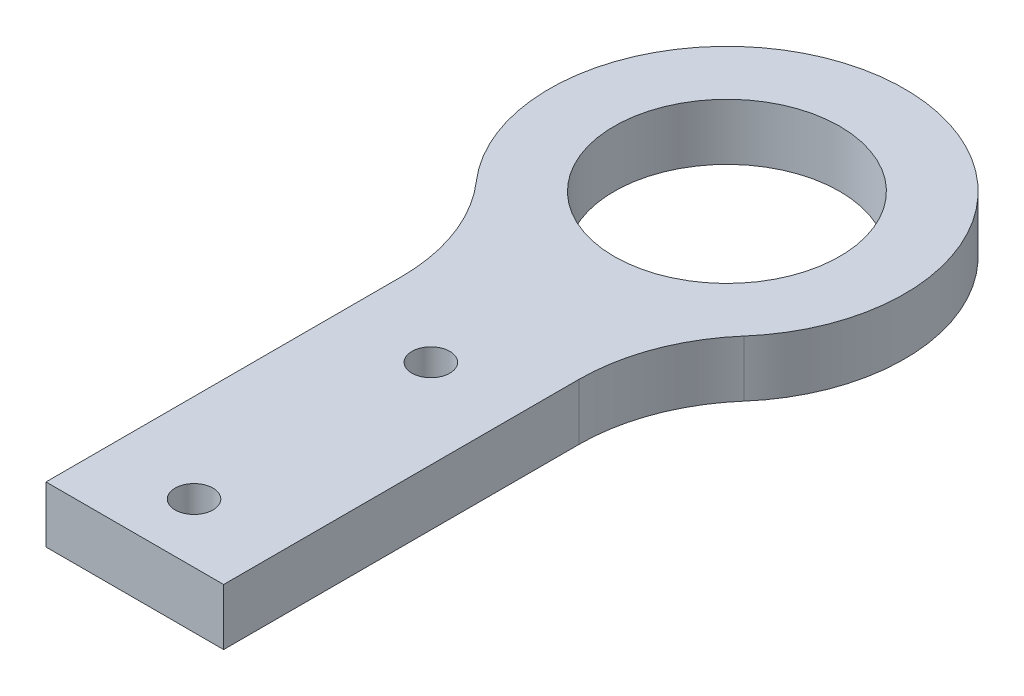
ISO-10303-21;
HEADER;
FILE_DESCRIPTION(('STEP AP214'),'2;1');
FILE_NAME('part.step','',(''),(''),'','','');
FILE_SCHEMA(('AUTOMOTIVE_DESIGN { 1 0 10303 214 1 1 1 1 }'));
ENDSEC;
DATA;
#1=APPLICATION_CONTEXT('core data for automotive mechanical design processes');
#2=APPLICATION_PROTOCOL_DEFINITION('international standard','automotive_design',2000,#1);
#3=PRODUCT_CONTEXT('',#1,'mechanical');
#4=PRODUCT('Part','Part','',(#3));
#5=PRODUCT_RELATED_PRODUCT_CATEGORY('part','',(#4));
#6=PRODUCT_DEFINITION_FORMATION('','',#4);
#7=PRODUCT_DEFINITION_CONTEXT('part definition',#1,'design');
#8=PRODUCT_DEFINITION('design','',#6,#7);
#9=PRODUCT_DEFINITION_SHAPE('','',#8);
#10=(LENGTH_UNIT() NAMED_UNIT(*) SI_UNIT(.MILLI.,.METRE.));
#11=(NAMED_UNIT(*) PLANE_ANGLE_UNIT() SI_UNIT($,.RADIAN.));
#12=(NAMED_UNIT(*) SI_UNIT($,.STERADIAN.) SOLID_ANGLE_UNIT());
#13=UNCERTAINTY_MEASURE_WITH_UNIT(LENGTH_MEASURE(1.E-05),#10,'distance_accuracy_value','');
#14=(GEOMETRIC_REPRESENTATION_CONTEXT(3) GLOBAL_UNCERTAINTY_ASSIGNED_CONTEXT((#13)) GLOBAL_UNIT_ASSIGNED_CONTEXT((#10,
#11,#12)) REPRESENTATION_CONTEXT('',''));
#15=CARTESIAN_POINT('',(0.,0.,0.));
#16=DIRECTION('',(0.,0.,1.));
#17=DIRECTION('',(1.,0.,0.));
#18=AXIS2_PLACEMENT_3D('',#15,#16,#17);
#19=CARTESIAN_POINT('',(22.9166666666667,4.7625,-30.));
#20=DIRECTION('',(0.,-1.,0.));
#21=DIRECTION('',(0.,0.,-1.));
#22=AXIS2_PLACEMENT_3D('',#19,#20,#21);
#23=PLANE('',#22);
#24=CARTESIAN_POINT('',(0.,4.7625,-5.));
#25=DIRECTION('',(0.,1.,0.));
#26=DIRECTION('',(0.,0.,1.));
#27=AXIS2_PLACEMENT_3D('',#24,#25,#26);
#28=CIRCLE('',#27,1.6);
#29=CARTESIAN_POINT('',(0.,4.7625,-3.4));
#30=VERTEX_POINT('',#29);
#31=EDGE_CURVE('E185',#30,#30,#28,.T.);
#32=ORIENTED_EDGE('',*,*,#31,.F.);
#33=EDGE_LOOP('',(#32));
#34=FACE_BOUND('',#33,.T.);
#35=DIRECTION('',(0.,0.,1.));
#36=VECTOR('',#35,1.);
#37=CARTESIAN_POINT('',(-7.5,4.7625,-30.));
#38=LINE('',#37,#36);
#39=CARTESIAN_POINT('',(-7.5,4.7625,-30.));
#40=VERTEX_POINT('',#39);
#41=CARTESIAN_POINT('',(-7.5,4.7625,0.));
#42=VERTEX_POINT('',#41);
#43=EDGE_CURVE('E129',#40,#42,#38,.T.);
#44=ORIENTED_EDGE('',*,*,#43,.T.);
#45=DIRECTION('',(1.,0.,0.));
#46=VECTOR('',#45,1.);
#47=CARTESIAN_POINT('',(-7.5,4.7625,0.));
#48=LINE('',#47,#46);
#49=CARTESIAN_POINT('',(7.5,4.7625,0.));
#50=VERTEX_POINT('',#49);
#51=EDGE_CURVE('E87',#42,#50,#48,.T.);
#52=ORIENTED_EDGE('',*,*,#51,.T.);
#53=DIRECTION('',(0.,0.,-1.));
#54=VECTOR('',#53,1.);
#55=CARTESIAN_POINT('',(7.5,4.7625,0.));
#56=LINE('',#55,#54);
#57=CARTESIAN_POINT('',(7.5,4.7625,-30.));
#58=VERTEX_POINT('',#57);
#59=EDGE_CURVE('E100',#50,#58,#56,.T.);
#60=ORIENTED_EDGE('',*,*,#59,.T.);
#61=CARTESIAN_POINT('',(22.9166666666667,4.7625,-30.));
#62=DIRECTION('',(0.,-1.,0.));
#63=DIRECTION('',(0.,0.,-1.));
#64=AXIS2_PLACEMENT_3D('',#61,#62,#63);
#65=CIRCLE('',#64,15.4166666666667);
#66=CARTESIAN_POINT('',(11.3013698630137,4.7625,-40.1369863013699));
#67=VERTEX_POINT('',#66);
#68=EDGE_CURVE('E94',#58,#67,#65,.T.);
#69=ORIENTED_EDGE('',*,*,#68,.T.);
#70=CARTESIAN_POINT('',(0.,4.7625,-50.));
#71=DIRECTION('',(0.,1.,0.));
#72=DIRECTION('',(0.,0.,1.));
#73=AXIS2_PLACEMENT_3D('',#70,#71,#72);
#74=CIRCLE('',#73,15.);
#75=CARTESIAN_POINT('',(-11.3013698630137,4.7625,-40.1369863013699));
#76=VERTEX_POINT('',#75);
#77=EDGE_CURVE('E98',#67,#76,#74,.T.);
#78=ORIENTED_EDGE('',*,*,#77,.T.);
#79=CARTESIAN_POINT('',(-22.9166666666667,4.7625,-30.));
#80=DIRECTION('',(0.,-1.,0.));
#81=DIRECTION('',(0.,0.,-1.));
#82=AXIS2_PLACEMENT_3D('',#79,#80,#81);
#83=CIRCLE('',#82,15.4166666666667);
#84=EDGE_CURVE('E50',#76,#40,#83,.T.);
#85=ORIENTED_EDGE('',*,*,#84,.T.);
#86=EDGE_LOOP('',(#44,#52,#60,#69,#78,#85));
#87=FACE_BOUND('',#86,.T.);
#88=CARTESIAN_POINT('',(0.,4.7625,-50.));
#89=DIRECTION('',(0.,1.,0.));
#90=DIRECTION('',(0.,0.,1.));
#91=AXIS2_PLACEMENT_3D('',#88,#89,#90);
#92=CIRCLE('',#91,9.525);
#93=CARTESIAN_POINT('',(0.,4.7625,-40.475));
#94=VERTEX_POINT('',#93);
#95=EDGE_CURVE('E122',#94,#94,#92,.T.);
#96=ORIENTED_EDGE('',*,*,#95,.F.);
#97=EDGE_LOOP('',(#96));
#98=FACE_BOUND('',#97,.T.);
#99=CARTESIAN_POINT('',(0.,4.7625,-25.));
#100=DIRECTION('',(0.,1.,0.));
#101=DIRECTION('',(0.,0.,1.));
#102=AXIS2_PLACEMENT_3D('',#99,#100,#101);
#103=CIRCLE('',#102,1.6);
#104=CARTESIAN_POINT('',(0.,4.7625,-23.4));
#105=VERTEX_POINT('',#104);
#106=EDGE_CURVE('E176',#105,#105,#103,.T.);
#107=ORIENTED_EDGE('',*,*,#106,.F.);
#108=EDGE_LOOP('',(#107));
#109=FACE_BOUND('',#108,.T.);
#110=ADVANCED_FACE('F33',(#34,#87,#98,#109),#23,.F.);
#111=CARTESIAN_POINT('',(22.9166666666667,0.,-30.));
#112=DIRECTION('',(0.,-1.,0.));
#113=DIRECTION('',(0.,0.,-1.));
#114=AXIS2_PLACEMENT_3D('',#111,#112,#113);
#115=PLANE('',#114);
#116=CARTESIAN_POINT('',(0.,0.,-5.));
#117=DIRECTION('',(0.,1.,0.));
#118=DIRECTION('',(0.,0.,1.));
#119=AXIS2_PLACEMENT_3D('',#116,#117,#118);
#120=CIRCLE('',#119,1.6);
#121=CARTESIAN_POINT('',(0.,0.,-3.4));
#122=VERTEX_POINT('',#121);
#123=EDGE_CURVE('E182',#122,#122,#120,.T.);
#124=ORIENTED_EDGE('',*,*,#123,.T.);
#125=EDGE_LOOP('',(#124));
#126=FACE_BOUND('',#125,.T.);
#127=DIRECTION('',(0.,0.,1.));
#128=VECTOR('',#127,1.);
#129=CARTESIAN_POINT('',(-7.5,0.,-30.));
#130=LINE('',#129,#128);
#131=CARTESIAN_POINT('',(-7.5,0.,-30.));
#132=VERTEX_POINT('',#131);
#133=CARTESIAN_POINT('',(-7.5,0.,0.));
#134=VERTEX_POINT('',#133);
#135=EDGE_CURVE('E118',#132,#134,#130,.T.);
#136=ORIENTED_EDGE('',*,*,#135,.F.);
#137=CARTESIAN_POINT('',(-22.9166666666667,0.,-30.));
#138=DIRECTION('',(0.,-1.,0.));
#139=DIRECTION('',(0.,0.,-1.));
#140=AXIS2_PLACEMENT_3D('',#137,#138,#139);
#141=CIRCLE('',#140,15.4166666666667);
#142=CARTESIAN_POINT('',(-11.3013698630137,0.,-40.1369863013699));
#143=VERTEX_POINT('',#142);
#144=EDGE_CURVE('E79',#143,#132,#141,.T.);
#145=ORIENTED_EDGE('',*,*,#144,.F.);
#146=CARTESIAN_POINT('',(0.,0.,-50.));
#147=DIRECTION('',(0.,1.,0.));
#148=DIRECTION('',(0.,0.,1.));
#149=AXIS2_PLACEMENT_3D('',#146,#147,#148);
#150=CIRCLE('',#149,15.);
#151=CARTESIAN_POINT('',(11.3013698630137,0.,-40.1369863013699));
#152=VERTEX_POINT('',#151);
#153=EDGE_CURVE('E73',#152,#143,#150,.T.);
#154=ORIENTED_EDGE('',*,*,#153,.F.);
#155=CARTESIAN_POINT('',(22.9166666666667,0.,-30.));
#156=DIRECTION('',(0.,-1.,0.));
#157=DIRECTION('',(0.,0.,-1.));
#158=AXIS2_PLACEMENT_3D('',#155,#156,#157);
#159=CIRCLE('',#158,15.4166666666667);
#160=CARTESIAN_POINT('',(7.5,0.,-30.));
#161=VERTEX_POINT('',#160);
#162=EDGE_CURVE('E108',#161,#152,#159,.T.);
#163=ORIENTED_EDGE('',*,*,#162,.F.);
#164=DIRECTION('',(0.,0.,-1.));
#165=VECTOR('',#164,1.);
#166=CARTESIAN_POINT('',(7.5,0.,0.));
#167=LINE('',#166,#165);
#168=CARTESIAN_POINT('',(7.5,0.,0.));
#169=VERTEX_POINT('',#168);
#170=EDGE_CURVE('E124',#169,#161,#167,.T.);
#171=ORIENTED_EDGE('',*,*,#170,.F.);
#172=DIRECTION('',(1.,0.,0.));
#173=VECTOR('',#172,1.);
#174=CARTESIAN_POINT('',(-7.5,0.,0.));
#175=LINE('',#174,#173);
#176=EDGE_CURVE('E121',#134,#169,#175,.T.);
#177=ORIENTED_EDGE('',*,*,#176,.F.);
#178=EDGE_LOOP('',(#136,#145,#154,#163,#171,#177));
#179=FACE_BOUND('',#178,.T.);
#180=CARTESIAN_POINT('',(0.,0.,-50.));
#181=DIRECTION('',(0.,1.,0.));
#182=DIRECTION('',(0.,0.,1.));
#183=AXIS2_PLACEMENT_3D('',#180,#181,#182);
#184=CIRCLE('',#183,9.525);
#185=CARTESIAN_POINT('',(0.,0.,-40.475));
#186=VERTEX_POINT('',#185);
#187=EDGE_CURVE('E188',#186,#186,#184,.T.);
#188=ORIENTED_EDGE('',*,*,#187,.T.);
#189=EDGE_LOOP('',(#188));
#190=FACE_BOUND('',#189,.T.);
#191=CARTESIAN_POINT('',(0.,0.,-25.));
#192=DIRECTION('',(0.,1.,0.));
#193=DIRECTION('',(0.,0.,1.));
#194=AXIS2_PLACEMENT_3D('',#191,#192,#193);
#195=CIRCLE('',#194,1.6);
#196=CARTESIAN_POINT('',(0.,0.,-23.4));
#197=VERTEX_POINT('',#196);
#198=EDGE_CURVE('E179',#197,#197,#195,.T.);
#199=ORIENTED_EDGE('',*,*,#198,.T.);
#200=EDGE_LOOP('',(#199));
#201=FACE_BOUND('',#200,.T.);
#202=ADVANCED_FACE('F138',(#126,#179,#190,#201),#115,.T.);
#203=CARTESIAN_POINT('',(-7.5,4.7625,-30.));
#204=DIRECTION('',(1.,0.,0.));
#205=DIRECTION('',(0.,0.,-1.));
#206=AXIS2_PLACEMENT_3D('',#203,#204,#205);
#207=PLANE('',#206);
#208=ORIENTED_EDGE('',*,*,#135,.T.);
#209=DIRECTION('',(0.,-1.,0.));
#210=VECTOR('',#209,1.);
#211=CARTESIAN_POINT('',(-7.5,4.7625,0.));
#212=LINE('',#211,#210);
#213=EDGE_CURVE('E11',#42,#134,#212,.T.);
#214=ORIENTED_EDGE('',*,*,#213,.F.);
#215=ORIENTED_EDGE('',*,*,#43,.F.);
#216=DIRECTION('',(0.,-1.,0.));
#217=VECTOR('',#216,1.);
#218=CARTESIAN_POINT('',(-7.5,4.7625,-30.));
#219=LINE('',#218,#217);
#220=EDGE_CURVE('E114',#40,#132,#219,.T.);
#221=ORIENTED_EDGE('',*,*,#220,.T.);
#222=EDGE_LOOP('',(#208,#214,#215,#221));
#223=FACE_BOUND('',#222,.T.);
#224=ADVANCED_FACE('F35',(#223),#207,.F.);
#225=CARTESIAN_POINT('',(-7.5,4.7625,0.));
#226=DIRECTION('',(0.,0.,-1.));
#227=DIRECTION('',(-1.,0.,0.));
#228=AXIS2_PLACEMENT_3D('',#225,#226,#227);
#229=PLANE('',#228);
#230=ORIENTED_EDGE('',*,*,#176,.T.);
#231=DIRECTION('',(0.,-1.,0.));
#232=VECTOR('',#231,1.);
#233=CARTESIAN_POINT('',(7.5,4.7625,0.));
#234=LINE('',#233,#232);
#235=EDGE_CURVE('E42',#50,#169,#234,.T.);
#236=ORIENTED_EDGE('',*,*,#235,.F.);
#237=ORIENTED_EDGE('',*,*,#51,.F.);
#238=ORIENTED_EDGE('',*,*,#213,.T.);
#239=EDGE_LOOP('',(#230,#236,#237,#238));
#240=FACE_BOUND('',#239,.T.);
#241=ADVANCED_FACE('F237',(#240),#229,.F.);
#242=CARTESIAN_POINT('',(7.5,4.7625,0.));
#243=DIRECTION('',(-1.,0.,0.));
#244=DIRECTION('',(0.,0.,1.));
#245=AXIS2_PLACEMENT_3D('',#242,#243,#244);
#246=PLANE('',#245);
#247=ORIENTED_EDGE('',*,*,#170,.T.);
#248=DIRECTION('',(0.,-1.,0.));
#249=VECTOR('',#248,1.);
#250=CARTESIAN_POINT('',(7.5,4.7625,-30.));
#251=LINE('',#250,#249);
#252=EDGE_CURVE('E109',#58,#161,#251,.T.);
#253=ORIENTED_EDGE('',*,*,#252,.F.);
#254=ORIENTED_EDGE('',*,*,#59,.F.);
#255=ORIENTED_EDGE('',*,*,#235,.T.);
#256=EDGE_LOOP('',(#247,#253,#254,#255));
#257=FACE_BOUND('',#256,.T.);
#258=ADVANCED_FACE('F135',(#257),#246,.F.);
#259=CARTESIAN_POINT('',(22.9166666666667,4.7625,-30.));
#260=DIRECTION('',(0.,-1.,0.));
#261=DIRECTION('',(0.,0.,-1.));
#262=AXIS2_PLACEMENT_3D('',#259,#260,#261);
#263=CYLINDRICAL_SURFACE('',#262,15.4166666666667);
#264=ORIENTED_EDGE('',*,*,#162,.T.);
#265=DIRECTION('',(0.,-1.,0.));
#266=VECTOR('',#265,1.);
#267=CARTESIAN_POINT('',(11.3013698630137,4.7625,-40.1369863013699));
#268=LINE('',#267,#266);
#269=EDGE_CURVE('E105',#67,#152,#268,.T.);
#270=ORIENTED_EDGE('',*,*,#269,.F.);
#271=ORIENTED_EDGE('',*,*,#68,.F.);
#272=ORIENTED_EDGE('',*,*,#252,.T.);
#273=EDGE_LOOP('',(#264,#270,#271,#272));
#274=FACE_BOUND('',#273,.T.);
#275=ADVANCED_FACE('F106',(#274),#263,.F.);
#276=CARTESIAN_POINT('',(0.,4.7625,-50.));
#277=DIRECTION('',(0.,-1.,0.));
#278=DIRECTION('',(0.,0.,-1.));
#279=AXIS2_PLACEMENT_3D('',#276,#277,#278);
#280=CYLINDRICAL_SURFACE('',#279,15.);
#281=ORIENTED_EDGE('',*,*,#153,.T.);
#282=DIRECTION('',(0.,-1.,0.));
#283=VECTOR('',#282,1.);
#284=CARTESIAN_POINT('',(-11.3013698630137,4.7625,-40.1369863013699));
#285=LINE('',#284,#283);
#286=EDGE_CURVE('E110',#76,#143,#285,.T.);
#287=ORIENTED_EDGE('',*,*,#286,.F.);
#288=ORIENTED_EDGE('',*,*,#77,.F.);
#289=ORIENTED_EDGE('',*,*,#269,.T.);
#290=EDGE_LOOP('',(#281,#287,#288,#289));
#291=FACE_BOUND('',#290,.T.);
#292=ADVANCED_FACE('F112',(#291),#280,.T.);
#293=CARTESIAN_POINT('',(-22.9166666666667,4.7625,-30.));
#294=DIRECTION('',(0.,-1.,0.));
#295=DIRECTION('',(0.,0.,-1.));
#296=AXIS2_PLACEMENT_3D('',#293,#294,#295);
#297=CYLINDRICAL_SURFACE('',#296,15.4166666666667);
#298=ORIENTED_EDGE('',*,*,#144,.T.);
#299=ORIENTED_EDGE('',*,*,#220,.F.);
#300=ORIENTED_EDGE('',*,*,#84,.F.);
#301=ORIENTED_EDGE('',*,*,#286,.T.);
#302=EDGE_LOOP('',(#298,#299,#300,#301));
#303=FACE_BOUND('',#302,.T.);
#304=ADVANCED_FACE('F143',(#303),#297,.F.);
#305=CARTESIAN_POINT('',(0.,4.7625,-50.));
#306=DIRECTION('',(0.,-1.,0.));
#307=DIRECTION('',(0.,0.,-1.));
#308=AXIS2_PLACEMENT_3D('',#305,#306,#307);
#309=CYLINDRICAL_SURFACE('',#308,9.525);
#310=ORIENTED_EDGE('',*,*,#95,.T.);
#311=EDGE_LOOP('',(#310));
#312=FACE_BOUND('',#311,.T.);
#313=ORIENTED_EDGE('',*,*,#187,.F.);
#314=EDGE_LOOP('',(#313));
#315=FACE_BOUND('',#314,.T.);
#316=ADVANCED_FACE('F145',(#312,#315),#309,.F.);
#317=CARTESIAN_POINT('',(0.,4.7625,-5.));
#318=DIRECTION('',(0.,-1.,0.));
#319=DIRECTION('',(0.,0.,-1.));
#320=AXIS2_PLACEMENT_3D('',#317,#318,#319);
#321=CYLINDRICAL_SURFACE('',#320,1.6);
#322=ORIENTED_EDGE('',*,*,#31,.T.);
#323=EDGE_LOOP('',(#322));
#324=FACE_BOUND('',#323,.T.);
#325=ORIENTED_EDGE('',*,*,#123,.F.);
#326=EDGE_LOOP('',(#325));
#327=FACE_BOUND('',#326,.T.);
#328=ADVANCED_FACE('F151',(#324,#327),#321,.F.);
#329=CARTESIAN_POINT('',(0.,4.7625,-25.));
#330=DIRECTION('',(0.,-1.,0.));
#331=DIRECTION('',(0.,0.,-1.));
#332=AXIS2_PLACEMENT_3D('',#329,#330,#331);
#333=CYLINDRICAL_SURFACE('',#332,1.6);
#334=ORIENTED_EDGE('',*,*,#106,.T.);
#335=EDGE_LOOP('',(#334));
#336=FACE_BOUND('',#335,.T.);
#337=ORIENTED_EDGE('',*,*,#198,.F.);
#338=EDGE_LOOP('',(#337));
#339=FACE_BOUND('',#338,.T.);
#340=ADVANCED_FACE('F167',(#336,#339),#333,.F.);
#341=CLOSED_SHELL('',(#110,#202,#224,#241,#258,#275,#292,#304,#316,#328,#340));
#342=MANIFOLD_SOLID_BREP('B2',#341);
#343=ADVANCED_BREP_SHAPE_REPRESENTATION('',(#18,#342),#14);
#344=SHAPE_DEFINITION_REPRESENTATION(#9,#343);
ENDSEC;
END-ISO-10303-21;
